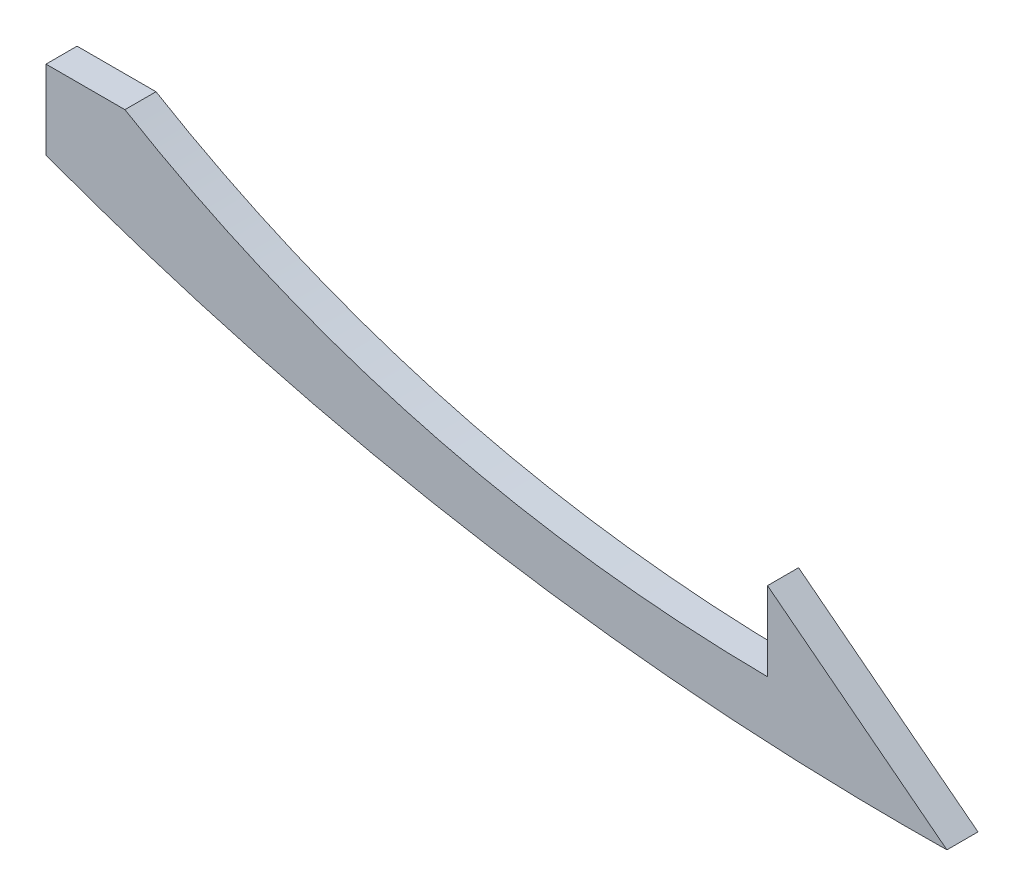
ISO-10303-21;
HEADER;
FILE_DESCRIPTION(('STEP AP214'),'2;1');
FILE_NAME('part.step','',(''),(''),'','','');
FILE_SCHEMA(('AUTOMOTIVE_DESIGN { 1 0 10303 214 1 1 1 1 }'));
ENDSEC;
DATA;
#1=APPLICATION_CONTEXT('core data for automotive mechanical design processes');
#2=APPLICATION_PROTOCOL_DEFINITION('international standard','automotive_design',2000,#1);
#3=PRODUCT_CONTEXT('',#1,'mechanical');
#4=PRODUCT('Part','Part','',(#3));
#5=PRODUCT_RELATED_PRODUCT_CATEGORY('part','',(#4));
#6=PRODUCT_DEFINITION_FORMATION('','',#4);
#7=PRODUCT_DEFINITION_CONTEXT('part definition',#1,'design');
#8=PRODUCT_DEFINITION('design','',#6,#7);
#9=PRODUCT_DEFINITION_SHAPE('','',#8);
#10=(LENGTH_UNIT() NAMED_UNIT(*) SI_UNIT(.MILLI.,.METRE.));
#11=(NAMED_UNIT(*) PLANE_ANGLE_UNIT() SI_UNIT($,.RADIAN.));
#12=(NAMED_UNIT(*) SI_UNIT($,.STERADIAN.) SOLID_ANGLE_UNIT());
#13=UNCERTAINTY_MEASURE_WITH_UNIT(LENGTH_MEASURE(1.E-05),#10,'distance_accuracy_value','');
#14=(GEOMETRIC_REPRESENTATION_CONTEXT(3) GLOBAL_UNCERTAINTY_ASSIGNED_CONTEXT((#13)) GLOBAL_UNIT_ASSIGNED_CONTEXT((#10,
#11,#12)) REPRESENTATION_CONTEXT('',''));
#15=CARTESIAN_POINT('',(0.,0.,0.));
#16=DIRECTION('',(0.,0.,1.));
#17=DIRECTION('',(1.,0.,0.));
#18=AXIS2_PLACEMENT_3D('',#15,#16,#17);
#19=CARTESIAN_POINT('',(0.,-6.35,5.));
#20=CARTESIAN_POINT('',(68.4114827417663,-31.7178408367322,5.));
#21=CARTESIAN_POINT('',(144.960512242138,-30.6605122421383,5.));
#22=B_SPLINE_CURVE_WITH_KNOTS('',2,(#19,#20,#21),.UNSPECIFIED.,.F.,.F.,(3,3),(0.,
0.711550610301736),.UNSPECIFIED.);
#23=DIRECTION('',(0.,0.,-1.));
#24=VECTOR('',#23,1.);
#25=SURFACE_OF_LINEAR_EXTRUSION('',#22,#24);
#26=CARTESIAN_POINT('',(0.,-6.35,0.));
#27=CARTESIAN_POINT('',(68.4114827417663,-31.7178408367322,0.));
#28=CARTESIAN_POINT('',(144.960512242138,-30.6605122421383,0.));
#29=B_SPLINE_CURVE_WITH_KNOTS('',2,(#26,#27,#28),.UNSPECIFIED.,.F.,.F.,(3,3),(0.,
0.711550610301736),.UNSPECIFIED.);
#30=CARTESIAN_POINT('',(0.,-6.35,0.));
#31=VERTEX_POINT('',#30);
#32=CARTESIAN_POINT('',(144.960512242138,-30.6605122421383,0.));
#33=VERTEX_POINT('',#32);
#34=EDGE_CURVE('E121',#31,#33,#29,.T.);
#35=ORIENTED_EDGE('',*,*,#34,.T.);
#36=DIRECTION('',(0.,0.,-1.));
#37=VECTOR('',#36,1.);
#38=CARTESIAN_POINT('',(144.960512242138,-30.6605122421383,5.));
#39=LINE('',#38,#37);
#40=CARTESIAN_POINT('',(144.960512242138,-30.6605122421383,5.));
#41=VERTEX_POINT('',#40);
#42=EDGE_CURVE('E11',#41,#33,#39,.T.);
#43=ORIENTED_EDGE('',*,*,#42,.F.);
#44=CARTESIAN_POINT('',(0.,-6.35,5.));
#45=VERTEX_POINT('',#44);
#46=EDGE_CURVE('E141',#45,#41,#22,.T.);
#47=ORIENTED_EDGE('',*,*,#46,.F.);
#48=DIRECTION('',(0.,0.,-1.));
#49=VECTOR('',#48,1.);
#50=CARTESIAN_POINT('',(0.,-6.35,5.));
#51=LINE('',#50,#49);
#52=EDGE_CURVE('E114',#45,#31,#51,.T.);
#53=ORIENTED_EDGE('',*,*,#52,.T.);
#54=EDGE_LOOP('',(#35,#43,#47,#53));
#55=FACE_BOUND('',#54,.T.);
#56=ADVANCED_FACE('F33',(#55),#25,.F.);
#57=CARTESIAN_POINT('',(116.093902260005,-8.27491352584355,5.));
#58=DIRECTION('',(-0.6128106662527,-0.790229768691943,0.));
#59=DIRECTION('',(0.790229768691943,-0.612810666252701,0.));
#60=AXIS2_PLACEMENT_3D('',#57,#58,#59);
#61=PLANE('',#60);
#62=DIRECTION('',(-0.790229768691943,0.6128106662527,0.));
#63=VECTOR('',#62,1.);
#64=CARTESIAN_POINT('',(116.093902260005,-8.27491352584355,0.));
#65=LINE('',#64,#63);
#66=CARTESIAN_POINT('',(116.093902260005,-8.27491352584355,0.));
#67=VERTEX_POINT('',#66);
#68=EDGE_CURVE('E126',#33,#67,#65,.T.);
#69=ORIENTED_EDGE('',*,*,#68,.T.);
#70=DIRECTION('',(0.,0.,-1.));
#71=VECTOR('',#70,1.);
#72=CARTESIAN_POINT('',(116.093902260005,-8.27491352584355,5.));
#73=LINE('',#72,#71);
#74=CARTESIAN_POINT('',(116.093902260005,-8.27491352584355,5.));
#75=VERTEX_POINT('',#74);
#76=EDGE_CURVE('E42',#75,#67,#73,.T.);
#77=ORIENTED_EDGE('',*,*,#76,.F.);
#78=DIRECTION('',(-0.790229768691943,0.6128106662527,0.));
#79=VECTOR('',#78,1.);
#80=CARTESIAN_POINT('',(116.093902260005,-8.27491352584355,5.));
#81=LINE('',#80,#79);
#82=EDGE_CURVE('E87',#41,#75,#81,.T.);
#83=ORIENTED_EDGE('',*,*,#82,.F.);
#84=ORIENTED_EDGE('',*,*,#42,.T.);
#85=EDGE_LOOP('',(#69,#77,#83,#84));
#86=FACE_BOUND('',#85,.T.);
#87=ADVANCED_FACE('F165',(#86),#61,.F.);
#88=CARTESIAN_POINT('',(116.093902260005,-20.9749135258435,5.));
#89=DIRECTION('',(1.,0.,0.));
#90=DIRECTION('',(0.,0.,-1.));
#91=AXIS2_PLACEMENT_3D('',#88,#89,#90);
#92=PLANE('',#91);
#93=DIRECTION('',(0.,-1.,0.));
#94=VECTOR('',#93,1.);
#95=CARTESIAN_POINT('',(116.093902260005,-20.9749135258435,0.));
#96=LINE('',#95,#94);
#97=CARTESIAN_POINT('',(116.093902260005,-20.9749135258435,0.));
#98=VERTEX_POINT('',#97);
#99=EDGE_CURVE('E131',#67,#98,#96,.T.);
#100=ORIENTED_EDGE('',*,*,#99,.T.);
#101=DIRECTION('',(0.,0.,-1.));
#102=VECTOR('',#101,1.);
#103=CARTESIAN_POINT('',(116.093902260005,-20.9749135258435,5.));
#104=LINE('',#103,#102);
#105=CARTESIAN_POINT('',(116.093902260005,-20.9749135258435,5.));
#106=VERTEX_POINT('',#105);
#107=EDGE_CURVE('E109',#106,#98,#104,.T.);
#108=ORIENTED_EDGE('',*,*,#107,.F.);
#109=DIRECTION('',(0.,-1.,0.));
#110=VECTOR('',#109,1.);
#111=CARTESIAN_POINT('',(116.093902260005,-20.9749135258435,5.));
#112=LINE('',#111,#110);
#113=EDGE_CURVE('E100',#75,#106,#112,.T.);
#114=ORIENTED_EDGE('',*,*,#113,.F.);
#115=ORIENTED_EDGE('',*,*,#76,.T.);
#116=EDGE_LOOP('',(#100,#108,#114,#115));
#117=FACE_BOUND('',#116,.T.);
#118=ADVANCED_FACE('F147',(#117),#92,.F.);
#119=CARTESIAN_POINT('',(116.093902260005,-20.9749135258435,5.));
#120=CARTESIAN_POINT('',(57.7824502878948,-20.4535910860437,5.));
#121=CARTESIAN_POINT('',(12.7,6.35,5.));
#122=B_SPLINE_CURVE_WITH_KNOTS('',2,(#119,#120,#121),.UNSPECIFIED.,.F.,.F.,(3,3),(0.,
0.666344136952199),.UNSPECIFIED.);
#123=DIRECTION('',(0.,0.,-1.));
#124=VECTOR('',#123,1.);
#125=SURFACE_OF_LINEAR_EXTRUSION('',#122,#124);
#126=CARTESIAN_POINT('',(116.093902260005,-20.9749135258435,0.));
#127=CARTESIAN_POINT('',(57.7824502878948,-20.4535910860437,0.));
#128=CARTESIAN_POINT('',(12.7,6.35,0.));
#129=B_SPLINE_CURVE_WITH_KNOTS('',2,(#126,#127,#128),.UNSPECIFIED.,.F.,.F.,(3,3),(0.,
0.666344136952199),.UNSPECIFIED.);
#130=CARTESIAN_POINT('',(12.7,6.35,0.));
#131=VERTEX_POINT('',#130);
#132=EDGE_CURVE('E108',#98,#131,#129,.T.);
#133=ORIENTED_EDGE('',*,*,#132,.T.);
#134=DIRECTION('',(0.,0.,-1.));
#135=VECTOR('',#134,1.);
#136=CARTESIAN_POINT('',(12.7,6.35,5.));
#137=LINE('',#136,#135);
#138=CARTESIAN_POINT('',(12.7,6.35,5.));
#139=VERTEX_POINT('',#138);
#140=EDGE_CURVE('E105',#139,#131,#137,.T.);
#141=ORIENTED_EDGE('',*,*,#140,.F.);
#142=EDGE_CURVE('E94',#106,#139,#122,.T.);
#143=ORIENTED_EDGE('',*,*,#142,.F.);
#144=ORIENTED_EDGE('',*,*,#107,.T.);
#145=EDGE_LOOP('',(#133,#141,#143,#144));
#146=FACE_BOUND('',#145,.T.);
#147=ADVANCED_FACE('F106',(#146),#125,.F.);
#148=CARTESIAN_POINT('',(0.,6.35,5.));
#149=DIRECTION('',(0.,-1.,0.));
#150=DIRECTION('',(0.,0.,-1.));
#151=AXIS2_PLACEMENT_3D('',#148,#149,#150);
#152=PLANE('',#151);
#153=DIRECTION('',(-1.,0.,0.));
#154=VECTOR('',#153,1.);
#155=CARTESIAN_POINT('',(0.,6.35,0.));
#156=LINE('',#155,#154);
#157=CARTESIAN_POINT('',(0.,6.35,0.));
#158=VERTEX_POINT('',#157);
#159=EDGE_CURVE('E73',#131,#158,#156,.T.);
#160=ORIENTED_EDGE('',*,*,#159,.T.);
#161=DIRECTION('',(0.,0.,-1.));
#162=VECTOR('',#161,1.);
#163=CARTESIAN_POINT('',(0.,6.35,5.));
#164=LINE('',#163,#162);
#165=CARTESIAN_POINT('',(0.,6.35,5.));
#166=VERTEX_POINT('',#165);
#167=EDGE_CURVE('E110',#166,#158,#164,.T.);
#168=ORIENTED_EDGE('',*,*,#167,.F.);
#169=DIRECTION('',(-1.,0.,0.));
#170=VECTOR('',#169,1.);
#171=CARTESIAN_POINT('',(0.,6.35,5.));
#172=LINE('',#171,#170);
#173=EDGE_CURVE('E98',#139,#166,#172,.T.);
#174=ORIENTED_EDGE('',*,*,#173,.F.);
#175=ORIENTED_EDGE('',*,*,#140,.T.);
#176=EDGE_LOOP('',(#160,#168,#174,#175));
#177=FACE_BOUND('',#176,.T.);
#178=ADVANCED_FACE('F112',(#177),#152,.F.);
#179=CARTESIAN_POINT('',(0.,-6.35,5.));
#180=DIRECTION('',(1.,0.,0.));
#181=DIRECTION('',(0.,1.,0.));
#182=AXIS2_PLACEMENT_3D('',#179,#180,#181);
#183=PLANE('',#182);
#184=DIRECTION('',(0.,-1.,0.));
#185=VECTOR('',#184,1.);
#186=CARTESIAN_POINT('',(0.,-6.35,0.));
#187=LINE('',#186,#185);
#188=EDGE_CURVE('E79',#158,#31,#187,.T.);
#189=ORIENTED_EDGE('',*,*,#188,.T.);
#190=ORIENTED_EDGE('',*,*,#52,.F.);
#191=DIRECTION('',(0.,-1.,0.));
#192=VECTOR('',#191,1.);
#193=CARTESIAN_POINT('',(0.,-6.35,5.));
#194=LINE('',#193,#192);
#195=EDGE_CURVE('E50',#166,#45,#194,.T.);
#196=ORIENTED_EDGE('',*,*,#195,.F.);
#197=ORIENTED_EDGE('',*,*,#167,.T.);
#198=EDGE_LOOP('',(#189,#190,#196,#197));
#199=FACE_BOUND('',#198,.T.);
#200=ADVANCED_FACE('F154',(#199),#183,.F.);
#201=CARTESIAN_POINT('',(70.4458694314177,-25.1115484789007,5.));
#202=DIRECTION('',(0.,0.,1.));
#203=DIRECTION('',(1.,0.,0.));
#204=AXIS2_PLACEMENT_3D('',#201,#202,#203);
#205=PLANE('',#204);
#206=ORIENTED_EDGE('',*,*,#46,.T.);
#207=ORIENTED_EDGE('',*,*,#82,.T.);
#208=ORIENTED_EDGE('',*,*,#113,.T.);
#209=ORIENTED_EDGE('',*,*,#142,.T.);
#210=ORIENTED_EDGE('',*,*,#173,.T.);
#211=ORIENTED_EDGE('',*,*,#195,.T.);
#212=EDGE_LOOP('',(#206,#207,#208,#209,#210,#211));
#213=FACE_BOUND('',#212,.T.);
#214=ADVANCED_FACE('F96',(#213),#205,.T.);
#215=CARTESIAN_POINT('',(70.4458694314177,-25.1115484789007,0.));
#216=DIRECTION('',(0.,0.,1.));
#217=DIRECTION('',(1.,0.,0.));
#218=AXIS2_PLACEMENT_3D('',#215,#216,#217);
#219=PLANE('',#218);
#220=ORIENTED_EDGE('',*,*,#34,.F.);
#221=ORIENTED_EDGE('',*,*,#188,.F.);
#222=ORIENTED_EDGE('',*,*,#159,.F.);
#223=ORIENTED_EDGE('',*,*,#132,.F.);
#224=ORIENTED_EDGE('',*,*,#99,.F.);
#225=ORIENTED_EDGE('',*,*,#68,.F.);
#226=EDGE_LOOP('',(#220,#221,#222,#223,#224,#225));
#227=FACE_BOUND('',#226,.T.);
#228=ADVANCED_FACE('F150',(#227),#219,.F.);
#229=CLOSED_SHELL('',(#56,#87,#118,#147,#178,#200,#214,#228));
#230=MANIFOLD_SOLID_BREP('B2',#229);
#231=ADVANCED_BREP_SHAPE_REPRESENTATION('',(#18,#230),#14);
#232=SHAPE_DEFINITION_REPRESENTATION(#9,#231);
ENDSEC;
END-ISO-10303-21;
